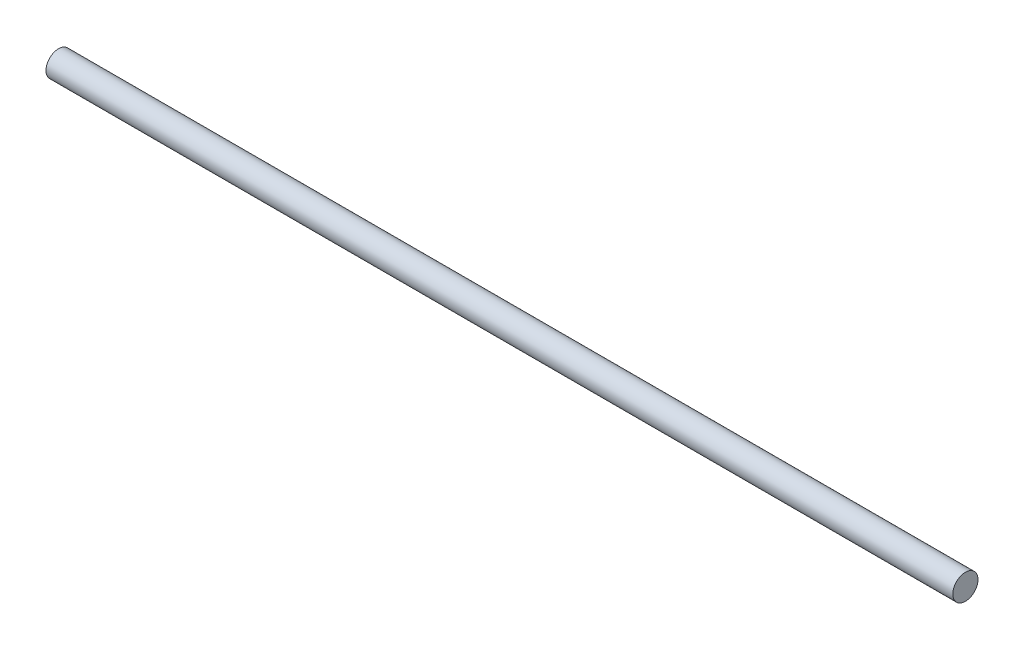
ISO-10303-21;
HEADER;
FILE_DESCRIPTION(('STEP AP214'),'2;1');
FILE_NAME('part.step','',(''),(''),'','','');
FILE_SCHEMA(('AUTOMOTIVE_DESIGN { 1 0 10303 214 1 1 1 1 }'));
ENDSEC;
DATA;
#1=APPLICATION_CONTEXT('core data for automotive mechanical design processes');
#2=APPLICATION_PROTOCOL_DEFINITION('international standard','automotive_design',2000,#1);
#3=PRODUCT_CONTEXT('',#1,'mechanical');
#4=PRODUCT('Part','Part','',(#3));
#5=PRODUCT_RELATED_PRODUCT_CATEGORY('part','',(#4));
#6=PRODUCT_DEFINITION_FORMATION('','',#4);
#7=PRODUCT_DEFINITION_CONTEXT('part definition',#1,'design');
#8=PRODUCT_DEFINITION('design','',#6,#7);
#9=PRODUCT_DEFINITION_SHAPE('','',#8);
#10=(LENGTH_UNIT() NAMED_UNIT(*) SI_UNIT(.MILLI.,.METRE.));
#11=(NAMED_UNIT(*) PLANE_ANGLE_UNIT() SI_UNIT($,.RADIAN.));
#12=(NAMED_UNIT(*) SI_UNIT($,.STERADIAN.) SOLID_ANGLE_UNIT());
#13=UNCERTAINTY_MEASURE_WITH_UNIT(LENGTH_MEASURE(1.E-05),#10,'distance_accuracy_value','');
#14=(GEOMETRIC_REPRESENTATION_CONTEXT(3) GLOBAL_UNCERTAINTY_ASSIGNED_CONTEXT((#13)) GLOBAL_UNIT_ASSIGNED_CONTEXT((#10,
#11,#12)) REPRESENTATION_CONTEXT('',''));
#15=CARTESIAN_POINT('',(0.,0.,0.));
#16=DIRECTION('',(0.,0.,1.));
#17=DIRECTION('',(1.,0.,0.));
#18=AXIS2_PLACEMENT_3D('',#15,#16,#17);
#19=CARTESIAN_POINT('',(0.,0.,0.));
#20=DIRECTION('',(-1.,0.,0.));
#21=DIRECTION('',(0.,0.,1.));
#22=AXIS2_PLACEMENT_3D('',#19,#20,#21);
#23=PLANE('',#22);
#24=CARTESIAN_POINT('',(0.,0.,0.));
#25=DIRECTION('',(1.,0.,0.));
#26=DIRECTION('',(0.,0.,-1.));
#27=AXIS2_PLACEMENT_3D('',#24,#25,#26);
#28=CIRCLE('',#27,12.5);
#29=CARTESIAN_POINT('',(0.,0.,-12.5));
#30=VERTEX_POINT('',#29);
#31=EDGE_CURVE('E10',#30,#30,#28,.T.);
#32=ORIENTED_EDGE('',*,*,#31,.F.);
#33=EDGE_LOOP('',(#32));
#34=FACE_BOUND('',#33,.T.);
#35=ADVANCED_FACE('F30',(#34),#23,.T.);
#36=CARTESIAN_POINT('',(0.,0.,0.));
#37=DIRECTION('',(1.,0.,0.));
#38=DIRECTION('',(0.,0.,-1.));
#39=AXIS2_PLACEMENT_3D('',#36,#37,#38);
#40=CYLINDRICAL_SURFACE('',#39,12.5);
#41=ORIENTED_EDGE('',*,*,#31,.T.);
#42=EDGE_LOOP('',(#41));
#43=FACE_BOUND('',#42,.T.);
#44=CARTESIAN_POINT('',(900.,0.,0.));
#45=DIRECTION('',(1.,0.,0.));
#46=DIRECTION('',(0.,0.,-1.));
#47=AXIS2_PLACEMENT_3D('',#44,#45,#46);
#48=CIRCLE('',#47,12.5);
#49=CARTESIAN_POINT('',(900.,0.,-12.5));
#50=VERTEX_POINT('',#49);
#51=EDGE_CURVE('E36',#50,#50,#48,.T.);
#52=ORIENTED_EDGE('',*,*,#51,.F.);
#53=EDGE_LOOP('',(#52));
#54=FACE_BOUND('',#53,.T.);
#55=ADVANCED_FACE('F44',(#43,#54),#40,.T.);
#56=CARTESIAN_POINT('',(900.,0.,0.));
#57=DIRECTION('',(1.,0.,0.));
#58=DIRECTION('',(0.,0.,-1.));
#59=AXIS2_PLACEMENT_3D('',#56,#57,#58);
#60=PLANE('',#59);
#61=ORIENTED_EDGE('',*,*,#51,.T.);
#62=EDGE_LOOP('',(#61));
#63=FACE_BOUND('',#62,.T.);
#64=ADVANCED_FACE('F42',(#63),#60,.T.);
#65=CLOSED_SHELL('',(#35,#55,#64));
#66=MANIFOLD_SOLID_BREP('B2',#65);
#67=ADVANCED_BREP_SHAPE_REPRESENTATION('',(#18,#66),#14);
#68=SHAPE_DEFINITION_REPRESENTATION(#9,#67);
ENDSEC;
END-ISO-10303-21;
